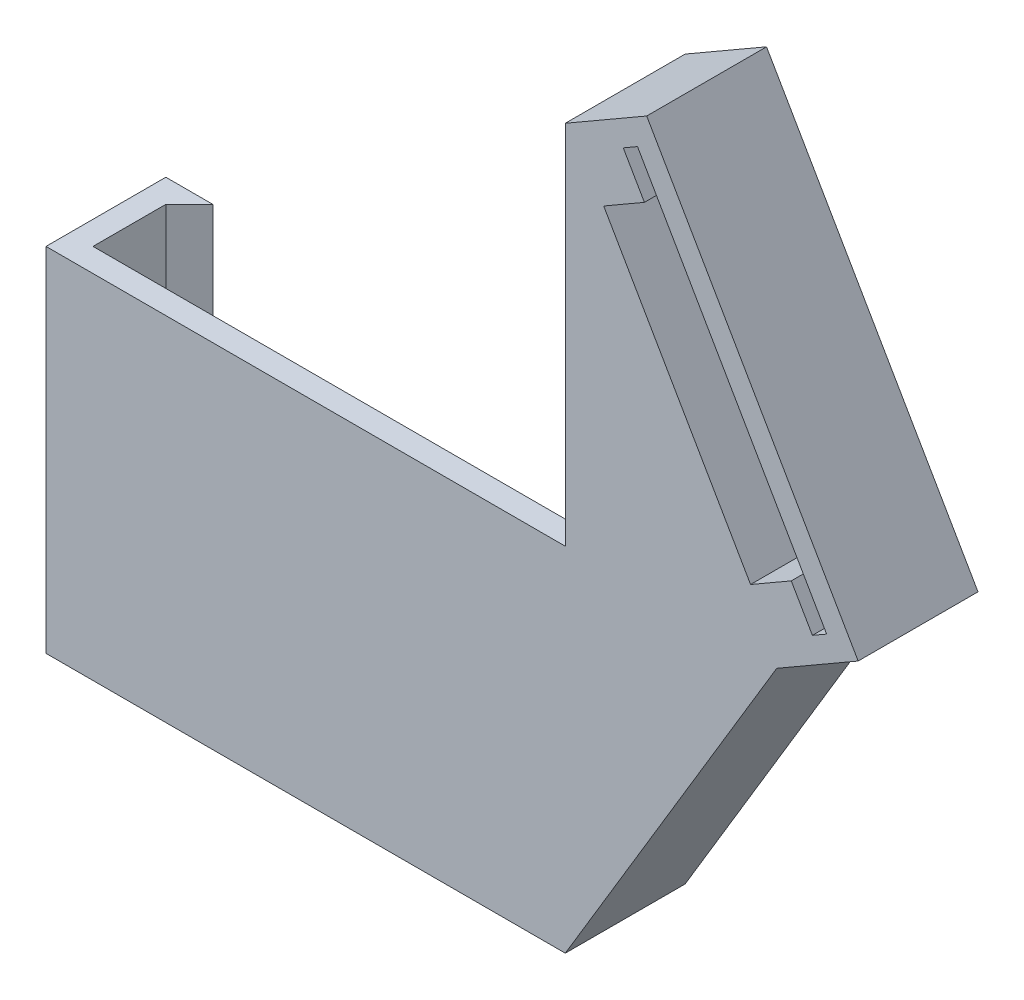
ISO-10303-21;
HEADER;
FILE_DESCRIPTION(('STEP AP214'),'2;1');
FILE_NAME('part.step','',(''),(''),'','','');
FILE_SCHEMA(('AUTOMOTIVE_DESIGN { 1 0 10303 214 1 1 1 1 }'));
ENDSEC;
DATA;
#1=APPLICATION_CONTEXT('core data for automotive mechanical design processes');
#2=APPLICATION_PROTOCOL_DEFINITION('international standard','automotive_design',2000,#1);
#3=PRODUCT_CONTEXT('',#1,'mechanical');
#4=PRODUCT('Part','Part','',(#3));
#5=PRODUCT_RELATED_PRODUCT_CATEGORY('part','',(#4));
#6=PRODUCT_DEFINITION_FORMATION('','',#4);
#7=PRODUCT_DEFINITION_CONTEXT('part definition',#1,'design');
#8=PRODUCT_DEFINITION('design','',#6,#7);
#9=PRODUCT_DEFINITION_SHAPE('','',#8);
#10=(LENGTH_UNIT() NAMED_UNIT(*) SI_UNIT(.MILLI.,.METRE.));
#11=(NAMED_UNIT(*) PLANE_ANGLE_UNIT() SI_UNIT($,.RADIAN.));
#12=(NAMED_UNIT(*) SI_UNIT($,.STERADIAN.) SOLID_ANGLE_UNIT());
#13=UNCERTAINTY_MEASURE_WITH_UNIT(LENGTH_MEASURE(1.E-05),#10,'distance_accuracy_value','');
#14=(GEOMETRIC_REPRESENTATION_CONTEXT(3) GLOBAL_UNCERTAINTY_ASSIGNED_CONTEXT((#13)) GLOBAL_UNIT_ASSIGNED_CONTEXT((#10,
#11,#12)) REPRESENTATION_CONTEXT('',''));
#15=CARTESIAN_POINT('',(0.,0.,0.));
#16=DIRECTION('',(0.,0.,1.));
#17=DIRECTION('',(1.,0.,0.));
#18=AXIS2_PLACEMENT_3D('',#15,#16,#17);
#19=CARTESIAN_POINT('',(-18.1,30.,-5.09999999999998));
#20=DIRECTION('',(-0.707106781186544,0.,-0.707106781186552));
#21=DIRECTION('',(-0.707106781186552,0.,0.707106781186544));
#22=AXIS2_PLACEMENT_3D('',#19,#20,#21);
#23=PLANE('',#22);
#24=DIRECTION('',(0.707106781186552,0.,-0.707106781186544));
#25=VECTOR('',#24,1.);
#26=CARTESIAN_POINT('',(-18.1,0.,-5.09999999999998));
#27=LINE('',#26,#25);
#28=CARTESIAN_POINT('',(-20.1,0.,-3.1));
#29=VERTEX_POINT('',#28);
#30=CARTESIAN_POINT('',(-18.1,0.,-5.09999999999998));
#31=VERTEX_POINT('',#30);
#32=EDGE_CURVE('E272',#29,#31,#27,.T.);
#33=ORIENTED_EDGE('',*,*,#32,.T.);
#34=DIRECTION('',(0.,-1.,0.));
#35=VECTOR('',#34,1.);
#36=CARTESIAN_POINT('',(-18.1,30.,-5.09999999999998));
#37=LINE('',#36,#35);
#38=CARTESIAN_POINT('',(-18.1,30.,-5.09999999999998));
#39=VERTEX_POINT('',#38);
#40=EDGE_CURVE('E11',#39,#31,#37,.T.);
#41=ORIENTED_EDGE('',*,*,#40,.F.);
#42=DIRECTION('',(0.707106781186552,0.,-0.707106781186544));
#43=VECTOR('',#42,1.);
#44=CARTESIAN_POINT('',(-18.1,30.,-5.09999999999998));
#45=LINE('',#44,#43);
#46=CARTESIAN_POINT('',(-20.1,30.,-3.1));
#47=VERTEX_POINT('',#46);
#48=EDGE_CURVE('E273',#47,#39,#45,.T.);
#49=ORIENTED_EDGE('',*,*,#48,.F.);
#50=DIRECTION('',(0.,-1.,0.));
#51=VECTOR('',#50,1.);
#52=CARTESIAN_POINT('',(-20.1,30.,-3.1));
#53=LINE('',#52,#51);
#54=EDGE_CURVE('E299',#47,#29,#53,.T.);
#55=ORIENTED_EDGE('',*,*,#54,.T.);
#56=EDGE_LOOP('',(#33,#41,#49,#55));
#57=FACE_BOUND('',#56,.T.);
#58=ADVANCED_FACE('F33',(#57),#23,.F.);
#59=CARTESIAN_POINT('',(-22.1,30.,-5.09999999999998));
#60=DIRECTION('',(0.,0.,1.));
#61=DIRECTION('',(1.,0.,0.));
#62=AXIS2_PLACEMENT_3D('',#59,#60,#61);
#63=PLANE('',#62);
#64=DIRECTION('',(-1.,0.,0.));
#65=VECTOR('',#64,1.);
#66=CARTESIAN_POINT('',(-22.1,0.,-5.09999999999998));
#67=LINE('',#66,#65);
#68=CARTESIAN_POINT('',(-22.1,0.,-5.09999999999998));
#69=VERTEX_POINT('',#68);
#70=EDGE_CURVE('E302',#31,#69,#67,.T.);
#71=ORIENTED_EDGE('',*,*,#70,.T.);
#72=DIRECTION('',(0.,-1.,0.));
#73=VECTOR('',#72,1.);
#74=CARTESIAN_POINT('',(-22.1,30.,-5.09999999999998));
#75=LINE('',#74,#73);
#76=CARTESIAN_POINT('',(-22.1,30.,-5.09999999999998));
#77=VERTEX_POINT('',#76);
#78=EDGE_CURVE('E40',#77,#69,#75,.T.);
#79=ORIENTED_EDGE('',*,*,#78,.F.);
#80=DIRECTION('',(-1.,0.,0.));
#81=VECTOR('',#80,1.);
#82=CARTESIAN_POINT('',(-22.1,30.,-5.09999999999998));
#83=LINE('',#82,#81);
#84=EDGE_CURVE('E276',#39,#77,#83,.T.);
#85=ORIENTED_EDGE('',*,*,#84,.F.);
#86=ORIENTED_EDGE('',*,*,#40,.T.);
#87=EDGE_LOOP('',(#71,#79,#85,#86));
#88=FACE_BOUND('',#87,.T.);
#89=ADVANCED_FACE('F363',(#88),#63,.F.);
#90=CARTESIAN_POINT('',(-22.1,30.,5.1));
#91=DIRECTION('',(1.,0.,0.));
#92=DIRECTION('',(0.,0.,-1.));
#93=AXIS2_PLACEMENT_3D('',#90,#91,#92);
#94=PLANE('',#93);
#95=DIRECTION('',(0.,0.,1.));
#96=VECTOR('',#95,1.);
#97=CARTESIAN_POINT('',(-22.1,0.,5.1));
#98=LINE('',#97,#96);
#99=CARTESIAN_POINT('',(-22.1,0.,5.1));
#100=VERTEX_POINT('',#99);
#101=EDGE_CURVE('E304',#69,#100,#98,.T.);
#102=ORIENTED_EDGE('',*,*,#101,.T.);
#103=DIRECTION('',(0.,-1.,0.));
#104=VECTOR('',#103,1.);
#105=CARTESIAN_POINT('',(-22.1,30.,5.1));
#106=LINE('',#105,#104);
#107=CARTESIAN_POINT('',(-22.1,30.,5.1));
#108=VERTEX_POINT('',#107);
#109=EDGE_CURVE('E340',#108,#100,#106,.T.);
#110=ORIENTED_EDGE('',*,*,#109,.F.);
#111=DIRECTION('',(0.,0.,1.));
#112=VECTOR('',#111,1.);
#113=CARTESIAN_POINT('',(-22.1,30.,5.1));
#114=LINE('',#113,#112);
#115=EDGE_CURVE('E279',#77,#108,#114,.T.);
#116=ORIENTED_EDGE('',*,*,#115,.F.);
#117=ORIENTED_EDGE('',*,*,#78,.T.);
#118=EDGE_LOOP('',(#102,#110,#116,#117));
#119=FACE_BOUND('',#118,.T.);
#120=ADVANCED_FACE('F347',(#119),#94,.F.);
#121=CARTESIAN_POINT('',(22.1,30.,5.1));
#122=DIRECTION('',(0.,0.,-1.));
#123=DIRECTION('',(-1.,0.,0.));
#124=AXIS2_PLACEMENT_3D('',#121,#122,#123);
#125=PLANE('',#124);
#126=DIRECTION('',(-0.499999999999995,0.866025403784442,0.));
#127=VECTOR('',#126,1.);
#128=CARTESIAN_POINT('',(44.3461524227063,34.6454482671903,5.1));
#129=LINE('',#128,#127);
#130=CARTESIAN_POINT('',(44.3461524227063,34.6454482671903,5.1));
#131=VERTEX_POINT('',#130);
#132=CARTESIAN_POINT('',(28.2461524227064,62.5314662690493,5.1));
#133=VERTEX_POINT('',#132);
#134=EDGE_CURVE('E199',#131,#133,#129,.T.);
#135=ORIENTED_EDGE('',*,*,#134,.F.);
#136=DIRECTION('',(0.866025403784442,0.499999999999994,0.));
#137=VECTOR('',#136,1.);
#138=CARTESIAN_POINT('',(44.3461524227063,34.6454482671903,5.1));
#139=LINE('',#138,#137);
#140=CARTESIAN_POINT('',(43.1337168574079,33.9454482671902,5.1));
#141=VERTEX_POINT('',#140);
#142=EDGE_CURVE('E47',#141,#131,#139,.T.);
#143=ORIENTED_EDGE('',*,*,#142,.F.);
#144=DIRECTION('',(0.499999999999966,-0.866025403784458,0.));
#145=VECTOR('',#144,1.);
#146=CARTESIAN_POINT('',(43.1337168574079,33.9454482671902,5.1));
#147=LINE('',#146,#145);
#148=CARTESIAN_POINT('',(41.333716857408,37.0631397208143,5.1));
#149=VERTEX_POINT('',#148);
#150=EDGE_CURVE('E221',#149,#141,#147,.T.);
#151=ORIENTED_EDGE('',*,*,#150,.F.);
#152=DIRECTION('',(0.866025403784443,0.499999999999992,0.));
#153=VECTOR('',#152,1.);
#154=CARTESIAN_POINT('',(41.333716857408,37.0631397208143,5.1));
#155=LINE('',#154,#153);
#156=CARTESIAN_POINT('',(37.8696152422702,35.0631397208143,5.1));
#157=VERTEX_POINT('',#156);
#158=EDGE_CURVE('E218',#157,#149,#155,.T.);
#159=ORIENTED_EDGE('',*,*,#158,.F.);
#160=DIRECTION('',(0.499999999999994,-0.866025403784442,0.));
#161=VECTOR('',#160,1.);
#162=CARTESIAN_POINT('',(25.3696152422703,56.7137748154253,5.1));
#163=LINE('',#162,#161);
#164=CARTESIAN_POINT('',(25.3696152422703,56.7137748154253,5.1));
#165=VERTEX_POINT('',#164);
#166=EDGE_CURVE('E215',#165,#157,#163,.T.);
#167=ORIENTED_EDGE('',*,*,#166,.F.);
#168=DIRECTION('',(-0.86602540378444,-0.499999999999997,0.));
#169=VECTOR('',#168,1.);
#170=CARTESIAN_POINT('',(28.8337168574081,58.7137748154253,5.1));
#171=LINE('',#170,#169);
#172=CARTESIAN_POINT('',(28.8337168574081,58.7137748154253,5.1));
#173=VERTEX_POINT('',#172);
#174=EDGE_CURVE('E209',#173,#165,#171,.T.);
#175=ORIENTED_EDGE('',*,*,#174,.F.);
#176=DIRECTION('',(0.499999999999962,-0.86602540378446,0.));
#177=VECTOR('',#176,1.);
#178=CARTESIAN_POINT('',(28.8337168574081,58.7137748154253,5.1));
#179=LINE('',#178,#177);
#180=CARTESIAN_POINT('',(27.0337168574082,61.8314662690493,5.1));
#181=VERTEX_POINT('',#180);
#182=EDGE_CURVE('E207',#181,#173,#179,.T.);
#183=ORIENTED_EDGE('',*,*,#182,.F.);
#184=DIRECTION('',(-0.866025403784446,-0.499999999999988,0.));
#185=VECTOR('',#184,1.);
#186=CARTESIAN_POINT('',(28.2461524227064,62.5314662690493,5.1));
#187=LINE('',#186,#185);
#188=EDGE_CURVE('E190',#133,#181,#187,.T.);
#189=ORIENTED_EDGE('',*,*,#188,.F.);
#190=EDGE_LOOP('',(#135,#143,#151,#159,#167,#175,#183,#189));
#191=FACE_BOUND('',#190,.T.);
#192=DIRECTION('',(1.,0.,0.));
#193=VECTOR('',#192,1.);
#194=CARTESIAN_POINT('',(22.1,0.,5.1));
#195=LINE('',#194,#193);
#196=CARTESIAN_POINT('',(22.1,0.,5.1));
#197=VERTEX_POINT('',#196);
#198=EDGE_CURVE('E306',#100,#197,#195,.T.);
#199=ORIENTED_EDGE('',*,*,#198,.T.);
#200=DIRECTION('',(0.514495755427523,0.857492925712547,0.));
#201=VECTOR('',#200,1.);
#202=CARTESIAN_POINT('',(40.0999999999998,30.,5.1));
#203=LINE('',#202,#201);
#204=CARTESIAN_POINT('',(40.0999999999998,30.,5.1));
#205=VERTEX_POINT('',#204);
#206=EDGE_CURVE('E261',#197,#205,#203,.T.);
#207=ORIENTED_EDGE('',*,*,#206,.T.);
#208=DIRECTION('',(0.866025403784442,0.499999999999994,0.));
#209=VECTOR('',#208,1.);
#210=CARTESIAN_POINT('',(47.0282032302753,34.,5.1));
#211=LINE('',#210,#209);
#212=CARTESIAN_POINT('',(47.0282032302753,34.,5.1));
#213=VERTEX_POINT('',#212);
#214=EDGE_CURVE('E238',#205,#213,#211,.T.);
#215=ORIENTED_EDGE('',*,*,#214,.T.);
#216=DIRECTION('',(-0.499999999999994,0.866025403784442,0.));
#217=VECTOR('',#216,1.);
#218=CARTESIAN_POINT('',(47.0282032302753,34.,5.1));
#219=LINE('',#218,#217);
#220=CARTESIAN_POINT('',(29.0282032302756,65.1769145362399,5.1));
#221=VERTEX_POINT('',#220);
#222=EDGE_CURVE('E252',#213,#221,#219,.T.);
#223=ORIENTED_EDGE('',*,*,#222,.T.);
#224=DIRECTION('',(-0.866025403784441,-0.499999999999996,0.));
#225=VECTOR('',#224,1.);
#226=CARTESIAN_POINT('',(29.0282032302756,65.1769145362399,5.1));
#227=LINE('',#226,#225);
#228=CARTESIAN_POINT('',(22.1,61.1769145362399,5.1));
#229=VERTEX_POINT('',#228);
#230=EDGE_CURVE('E255',#221,#229,#227,.T.);
#231=ORIENTED_EDGE('',*,*,#230,.T.);
#232=DIRECTION('',(0.,-1.,0.));
#233=VECTOR('',#232,1.);
#234=CARTESIAN_POINT('',(22.1,0.,5.1));
#235=LINE('',#234,#233);
#236=CARTESIAN_POINT('',(22.1,30.,5.1));
#237=VERTEX_POINT('',#236);
#238=EDGE_CURVE('E258',#229,#237,#235,.T.);
#239=ORIENTED_EDGE('',*,*,#238,.T.);
#240=DIRECTION('',(1.,0.,0.));
#241=VECTOR('',#240,1.);
#242=CARTESIAN_POINT('',(22.1,30.,5.1));
#243=LINE('',#242,#241);
#244=EDGE_CURVE('E281',#108,#237,#243,.T.);
#245=ORIENTED_EDGE('',*,*,#244,.F.);
#246=ORIENTED_EDGE('',*,*,#109,.T.);
#247=EDGE_LOOP('',(#199,#207,#215,#223,#231,#239,#245,#246));
#248=FACE_BOUND('',#247,.T.);
#249=ADVANCED_FACE('F203',(#191,#248),#125,.F.);
#250=CARTESIAN_POINT('',(18.1,30.,-5.09999999999998));
#251=DIRECTION('',(0.,0.,1.));
#252=DIRECTION('',(1.,0.,0.));
#253=AXIS2_PLACEMENT_3D('',#250,#251,#252);
#254=PLANE('',#253);
#255=DIRECTION('',(-0.499999999999966,0.866025403784458,0.));
#256=VECTOR('',#255,1.);
#257=CARTESIAN_POINT('',(43.1337168574079,33.9454482671902,-5.09999999999999));
#258=LINE('',#257,#256);
#259=CARTESIAN_POINT('',(43.1337168574079,33.9454482671902,-5.09999999999999));
#260=VERTEX_POINT('',#259);
#261=CARTESIAN_POINT('',(41.333716857408,37.0631397208143,-5.09999999999999));
#262=VERTEX_POINT('',#261);
#263=EDGE_CURVE('E488',#260,#262,#258,.T.);
#264=ORIENTED_EDGE('',*,*,#263,.F.);
#265=DIRECTION('',(-0.866025403784442,-0.499999999999994,0.));
#266=VECTOR('',#265,1.);
#267=CARTESIAN_POINT('',(44.3461524227063,34.6454482671903,-5.09999999999999));
#268=LINE('',#267,#266);
#269=CARTESIAN_POINT('',(44.3461524227063,34.6454482671903,-5.09999999999999));
#270=VERTEX_POINT('',#269);
#271=EDGE_CURVE('E239',#270,#260,#268,.T.);
#272=ORIENTED_EDGE('',*,*,#271,.F.);
#273=DIRECTION('',(0.499999999999995,-0.866025403784442,0.));
#274=VECTOR('',#273,1.);
#275=CARTESIAN_POINT('',(44.3461524227063,34.6454482671903,-5.09999999999999));
#276=LINE('',#275,#274);
#277=CARTESIAN_POINT('',(28.2461524227065,62.5314662690493,-5.09999999999998));
#278=VERTEX_POINT('',#277);
#279=EDGE_CURVE('E236',#278,#270,#276,.T.);
#280=ORIENTED_EDGE('',*,*,#279,.F.);
#281=DIRECTION('',(0.866025403784446,0.499999999999988,0.));
#282=VECTOR('',#281,1.);
#283=CARTESIAN_POINT('',(28.2461524227065,62.5314662690493,-5.09999999999998));
#284=LINE('',#283,#282);
#285=CARTESIAN_POINT('',(27.0337168574082,61.8314662690493,-5.09999999999998));
#286=VERTEX_POINT('',#285);
#287=EDGE_CURVE('E193',#286,#278,#284,.T.);
#288=ORIENTED_EDGE('',*,*,#287,.F.);
#289=DIRECTION('',(-0.499999999999962,0.86602540378446,0.));
#290=VECTOR('',#289,1.);
#291=CARTESIAN_POINT('',(28.8337168574081,58.7137748154253,-5.09999999999998));
#292=LINE('',#291,#290);
#293=CARTESIAN_POINT('',(28.8337168574081,58.7137748154253,-5.09999999999998));
#294=VERTEX_POINT('',#293);
#295=EDGE_CURVE('E506',#294,#286,#292,.T.);
#296=ORIENTED_EDGE('',*,*,#295,.F.);
#297=DIRECTION('',(0.86602540378444,0.499999999999997,0.));
#298=VECTOR('',#297,1.);
#299=CARTESIAN_POINT('',(28.8337168574081,58.7137748154253,-5.09999999999998));
#300=LINE('',#299,#298);
#301=CARTESIAN_POINT('',(25.3696152422703,56.7137748154253,-5.09999999999998));
#302=VERTEX_POINT('',#301);
#303=EDGE_CURVE('E501',#302,#294,#300,.T.);
#304=ORIENTED_EDGE('',*,*,#303,.F.);
#305=DIRECTION('',(-0.499999999999994,0.866025403784442,0.));
#306=VECTOR('',#305,1.);
#307=CARTESIAN_POINT('',(25.3696152422703,56.7137748154253,-5.09999999999998));
#308=LINE('',#307,#306);
#309=CARTESIAN_POINT('',(37.8696152422702,35.0631397208143,-5.09999999999998));
#310=VERTEX_POINT('',#309);
#311=EDGE_CURVE('E499',#310,#302,#308,.T.);
#312=ORIENTED_EDGE('',*,*,#311,.F.);
#313=DIRECTION('',(-0.866025403784443,-0.499999999999992,0.));
#314=VECTOR('',#313,1.);
#315=CARTESIAN_POINT('',(41.333716857408,37.0631397208143,-5.09999999999999));
#316=LINE('',#315,#314);
#317=EDGE_CURVE('E492',#262,#310,#316,.T.);
#318=ORIENTED_EDGE('',*,*,#317,.F.);
#319=EDGE_LOOP('',(#264,#272,#280,#288,#296,#304,#312,#318));
#320=FACE_BOUND('',#319,.T.);
#321=DIRECTION('',(-1.,0.,0.));
#322=VECTOR('',#321,1.);
#323=CARTESIAN_POINT('',(18.1,0.,-5.09999999999998));
#324=LINE('',#323,#322);
#325=CARTESIAN_POINT('',(22.1,0.,-5.09999999999998));
#326=VERTEX_POINT('',#325);
#327=CARTESIAN_POINT('',(18.1,0.,-5.09999999999998));
#328=VERTEX_POINT('',#327);
#329=EDGE_CURVE('E312',#326,#328,#324,.T.);
#330=ORIENTED_EDGE('',*,*,#329,.T.);
#331=DIRECTION('',(0.,-1.,0.));
#332=VECTOR('',#331,1.);
#333=CARTESIAN_POINT('',(18.1,30.,-5.09999999999998));
#334=LINE('',#333,#332);
#335=CARTESIAN_POINT('',(18.1,30.,-5.09999999999998));
#336=VERTEX_POINT('',#335);
#337=EDGE_CURVE('E337',#336,#328,#334,.T.);
#338=ORIENTED_EDGE('',*,*,#337,.F.);
#339=DIRECTION('',(-1.,0.,0.));
#340=VECTOR('',#339,1.);
#341=CARTESIAN_POINT('',(18.1,30.,-5.09999999999998));
#342=LINE('',#341,#340);
#343=CARTESIAN_POINT('',(22.1,30.,-5.09999999999998));
#344=VERTEX_POINT('',#343);
#345=EDGE_CURVE('E287',#344,#336,#342,.T.);
#346=ORIENTED_EDGE('',*,*,#345,.F.);
#347=DIRECTION('',(0.,1.,0.));
#348=VECTOR('',#347,1.);
#349=CARTESIAN_POINT('',(22.1,0.,-5.09999999999998));
#350=LINE('',#349,#348);
#351=CARTESIAN_POINT('',(22.1,61.1769145362399,-5.09999999999998));
#352=VERTEX_POINT('',#351);
#353=EDGE_CURVE('E242',#344,#352,#350,.T.);
#354=ORIENTED_EDGE('',*,*,#353,.T.);
#355=DIRECTION('',(0.866025403784441,0.499999999999996,0.));
#356=VECTOR('',#355,1.);
#357=CARTESIAN_POINT('',(29.0282032302756,65.1769145362399,-5.09999999999998));
#358=LINE('',#357,#356);
#359=CARTESIAN_POINT('',(29.0282032302756,65.1769145362399,-5.09999999999998));
#360=VERTEX_POINT('',#359);
#361=EDGE_CURVE('E240',#352,#360,#358,.T.);
#362=ORIENTED_EDGE('',*,*,#361,.T.);
#363=DIRECTION('',(0.499999999999994,-0.866025403784442,0.));
#364=VECTOR('',#363,1.);
#365=CARTESIAN_POINT('',(47.0282032302753,34.,-5.09999999999998));
#366=LINE('',#365,#364);
#367=CARTESIAN_POINT('',(47.0282032302753,34.,-5.09999999999998));
#368=VERTEX_POINT('',#367);
#369=EDGE_CURVE('E249',#360,#368,#366,.T.);
#370=ORIENTED_EDGE('',*,*,#369,.T.);
#371=DIRECTION('',(-0.866025403784442,-0.499999999999994,0.));
#372=VECTOR('',#371,1.);
#373=CARTESIAN_POINT('',(47.0282032302754,34.,-5.09999999999998));
#374=LINE('',#373,#372);
#375=CARTESIAN_POINT('',(40.0999999999998,30.,-5.09999999999998));
#376=VERTEX_POINT('',#375);
#377=EDGE_CURVE('E247',#368,#376,#374,.T.);
#378=ORIENTED_EDGE('',*,*,#377,.T.);
#379=DIRECTION('',(-0.514495755427523,-0.857492925712547,0.));
#380=VECTOR('',#379,1.);
#381=CARTESIAN_POINT('',(40.0999999999998,30.,-5.09999999999998));
#382=LINE('',#381,#380);
#383=EDGE_CURVE('E245',#376,#326,#382,.T.);
#384=ORIENTED_EDGE('',*,*,#383,.T.);
#385=EDGE_LOOP('',(#330,#338,#346,#354,#362,#370,#378,#384));
#386=FACE_BOUND('',#385,.T.);
#387=ADVANCED_FACE('F392',(#320,#386),#254,.F.);
#388=CARTESIAN_POINT('',(18.1,30.,-3.09999999999998));
#389=DIRECTION('',(1.,0.,0.));
#390=DIRECTION('',(0.,0.,-1.));
#391=AXIS2_PLACEMENT_3D('',#388,#389,#390);
#392=PLANE('',#391);
#393=DIRECTION('',(0.,0.,1.));
#394=VECTOR('',#393,1.);
#395=CARTESIAN_POINT('',(18.1,0.,-3.09999999999998));
#396=LINE('',#395,#394);
#397=CARTESIAN_POINT('',(18.1,0.,-3.09999999999998));
#398=VERTEX_POINT('',#397);
#399=EDGE_CURVE('E314',#328,#398,#396,.T.);
#400=ORIENTED_EDGE('',*,*,#399,.T.);
#401=DIRECTION('',(0.,-1.,0.));
#402=VECTOR('',#401,1.);
#403=CARTESIAN_POINT('',(18.1,30.,-3.09999999999998));
#404=LINE('',#403,#402);
#405=CARTESIAN_POINT('',(18.1,30.,-3.09999999999998));
#406=VERTEX_POINT('',#405);
#407=EDGE_CURVE('E334',#406,#398,#404,.T.);
#408=ORIENTED_EDGE('',*,*,#407,.F.);
#409=DIRECTION('',(0.,0.,1.));
#410=VECTOR('',#409,1.);
#411=CARTESIAN_POINT('',(18.1,30.,-3.09999999999998));
#412=LINE('',#411,#410);
#413=EDGE_CURVE('E289',#336,#406,#412,.T.);
#414=ORIENTED_EDGE('',*,*,#413,.F.);
#415=ORIENTED_EDGE('',*,*,#337,.T.);
#416=EDGE_LOOP('',(#400,#408,#414,#415));
#417=FACE_BOUND('',#416,.T.);
#418=ADVANCED_FACE('F389',(#417),#392,.F.);
#419=CARTESIAN_POINT('',(20.1,30.,-3.1));
#420=DIRECTION('',(0.,0.,-1.));
#421=DIRECTION('',(-1.,0.,0.));
#422=AXIS2_PLACEMENT_3D('',#419,#420,#421);
#423=PLANE('',#422);
#424=DIRECTION('',(1.,0.,0.));
#425=VECTOR('',#424,1.);
#426=CARTESIAN_POINT('',(20.1,0.,-3.1));
#427=LINE('',#426,#425);
#428=CARTESIAN_POINT('',(20.1,0.,-3.1));
#429=VERTEX_POINT('',#428);
#430=EDGE_CURVE('E316',#398,#429,#427,.T.);
#431=ORIENTED_EDGE('',*,*,#430,.T.);
#432=DIRECTION('',(0.,-1.,0.));
#433=VECTOR('',#432,1.);
#434=CARTESIAN_POINT('',(20.1,30.,-3.1));
#435=LINE('',#434,#433);
#436=CARTESIAN_POINT('',(20.1,30.,-3.1));
#437=VERTEX_POINT('',#436);
#438=EDGE_CURVE('E331',#437,#429,#435,.T.);
#439=ORIENTED_EDGE('',*,*,#438,.F.);
#440=DIRECTION('',(1.,0.,0.));
#441=VECTOR('',#440,1.);
#442=CARTESIAN_POINT('',(20.1,30.,-3.1));
#443=LINE('',#442,#441);
#444=EDGE_CURVE('E291',#406,#437,#443,.T.);
#445=ORIENTED_EDGE('',*,*,#444,.F.);
#446=ORIENTED_EDGE('',*,*,#407,.T.);
#447=EDGE_LOOP('',(#431,#439,#445,#446));
#448=FACE_BOUND('',#447,.T.);
#449=ADVANCED_FACE('F384',(#448),#423,.F.);
#450=CARTESIAN_POINT('',(20.1,30.,3.1));
#451=DIRECTION('',(1.,0.,0.));
#452=DIRECTION('',(0.,0.,-1.));
#453=AXIS2_PLACEMENT_3D('',#450,#451,#452);
#454=PLANE('',#453);
#455=DIRECTION('',(0.,0.,1.));
#456=VECTOR('',#455,1.);
#457=CARTESIAN_POINT('',(20.1,0.,3.1));
#458=LINE('',#457,#456);
#459=CARTESIAN_POINT('',(20.1,0.,3.1));
#460=VERTEX_POINT('',#459);
#461=EDGE_CURVE('E318',#429,#460,#458,.T.);
#462=ORIENTED_EDGE('',*,*,#461,.T.);
#463=DIRECTION('',(0.,-1.,0.));
#464=VECTOR('',#463,1.);
#465=CARTESIAN_POINT('',(20.1,30.,3.1));
#466=LINE('',#465,#464);
#467=CARTESIAN_POINT('',(20.1,30.,3.1));
#468=VERTEX_POINT('',#467);
#469=EDGE_CURVE('E328',#468,#460,#466,.T.);
#470=ORIENTED_EDGE('',*,*,#469,.F.);
#471=DIRECTION('',(0.,0.,1.));
#472=VECTOR('',#471,1.);
#473=CARTESIAN_POINT('',(20.1,30.,3.1));
#474=LINE('',#473,#472);
#475=EDGE_CURVE('E293',#437,#468,#474,.T.);
#476=ORIENTED_EDGE('',*,*,#475,.F.);
#477=ORIENTED_EDGE('',*,*,#438,.T.);
#478=EDGE_LOOP('',(#462,#470,#476,#477));
#479=FACE_BOUND('',#478,.T.);
#480=ADVANCED_FACE('F379',(#479),#454,.F.);
#481=CARTESIAN_POINT('',(20.1,30.,3.1));
#482=DIRECTION('',(0.,0.,1.));
#483=DIRECTION('',(1.,0.,0.));
#484=AXIS2_PLACEMENT_3D('',#481,#482,#483);
#485=PLANE('',#484);
#486=DIRECTION('',(-1.,0.,0.));
#487=VECTOR('',#486,1.);
#488=CARTESIAN_POINT('',(20.1,0.,3.1));
#489=LINE('',#488,#487);
#490=CARTESIAN_POINT('',(-20.1,0.,3.1));
#491=VERTEX_POINT('',#490);
#492=EDGE_CURVE('E320',#460,#491,#489,.T.);
#493=ORIENTED_EDGE('',*,*,#492,.T.);
#494=DIRECTION('',(0.,-1.,0.));
#495=VECTOR('',#494,1.);
#496=CARTESIAN_POINT('',(-20.1,30.,3.1));
#497=LINE('',#496,#495);
#498=CARTESIAN_POINT('',(-20.1,30.,3.1));
#499=VERTEX_POINT('',#498);
#500=EDGE_CURVE('E325',#499,#491,#497,.T.);
#501=ORIENTED_EDGE('',*,*,#500,.F.);
#502=DIRECTION('',(-1.,0.,0.));
#503=VECTOR('',#502,1.);
#504=CARTESIAN_POINT('',(20.1,30.,3.1));
#505=LINE('',#504,#503);
#506=EDGE_CURVE('E295',#468,#499,#505,.T.);
#507=ORIENTED_EDGE('',*,*,#506,.F.);
#508=ORIENTED_EDGE('',*,*,#469,.T.);
#509=EDGE_LOOP('',(#493,#501,#507,#508));
#510=FACE_BOUND('',#509,.T.);
#511=ADVANCED_FACE('F375',(#510),#485,.F.);
#512=CARTESIAN_POINT('',(-20.1,30.,3.1));
#513=DIRECTION('',(-1.,0.,0.));
#514=DIRECTION('',(0.,0.,1.));
#515=AXIS2_PLACEMENT_3D('',#512,#513,#514);
#516=PLANE('',#515);
#517=DIRECTION('',(0.,0.,-1.));
#518=VECTOR('',#517,1.);
#519=CARTESIAN_POINT('',(-20.1,0.,3.1));
#520=LINE('',#519,#518);
#521=EDGE_CURVE('E277',#491,#29,#520,.T.);
#522=ORIENTED_EDGE('',*,*,#521,.T.);
#523=ORIENTED_EDGE('',*,*,#54,.F.);
#524=DIRECTION('',(0.,0.,-1.));
#525=VECTOR('',#524,1.);
#526=CARTESIAN_POINT('',(-20.1,30.,3.1));
#527=LINE('',#526,#525);
#528=EDGE_CURVE('E297',#499,#47,#527,.T.);
#529=ORIENTED_EDGE('',*,*,#528,.F.);
#530=ORIENTED_EDGE('',*,*,#500,.T.);
#531=EDGE_LOOP('',(#522,#523,#529,#530));
#532=FACE_BOUND('',#531,.T.);
#533=ADVANCED_FACE('F370',(#532),#516,.F.);
#534=CARTESIAN_POINT('',(0.,30.,0.));
#535=DIRECTION('',(0.,-1.,0.));
#536=DIRECTION('',(0.,0.,-1.));
#537=AXIS2_PLACEMENT_3D('',#534,#535,#536);
#538=PLANE('',#537);
#539=ORIENTED_EDGE('',*,*,#48,.T.);
#540=ORIENTED_EDGE('',*,*,#84,.T.);
#541=ORIENTED_EDGE('',*,*,#115,.T.);
#542=ORIENTED_EDGE('',*,*,#244,.T.);
#543=DIRECTION('',(0.,0.,-1.));
#544=VECTOR('',#543,1.);
#545=CARTESIAN_POINT('',(22.1,30.,-5.09999999999998));
#546=LINE('',#545,#544);
#547=EDGE_CURVE('E284',#237,#344,#546,.T.);
#548=ORIENTED_EDGE('',*,*,#547,.T.);
#549=ORIENTED_EDGE('',*,*,#345,.T.);
#550=ORIENTED_EDGE('',*,*,#413,.T.);
#551=ORIENTED_EDGE('',*,*,#444,.T.);
#552=ORIENTED_EDGE('',*,*,#475,.T.);
#553=ORIENTED_EDGE('',*,*,#506,.T.);
#554=ORIENTED_EDGE('',*,*,#528,.T.);
#555=EDGE_LOOP('',(#539,#540,#541,#542,#548,#549,#550,#551,#552,#553,#554));
#556=FACE_BOUND('',#555,.T.);
#557=ADVANCED_FACE('F359',(#556),#538,.F.);
#558=CARTESIAN_POINT('',(0.,0.,0.));
#559=DIRECTION('',(0.,-1.,0.));
#560=DIRECTION('',(0.,0.,-1.));
#561=AXIS2_PLACEMENT_3D('',#558,#559,#560);
#562=PLANE('',#561);
#563=ORIENTED_EDGE('',*,*,#32,.F.);
#564=ORIENTED_EDGE('',*,*,#521,.F.);
#565=ORIENTED_EDGE('',*,*,#492,.F.);
#566=ORIENTED_EDGE('',*,*,#461,.F.);
#567=ORIENTED_EDGE('',*,*,#430,.F.);
#568=ORIENTED_EDGE('',*,*,#399,.F.);
#569=ORIENTED_EDGE('',*,*,#329,.F.);
#570=DIRECTION('',(0.,0.,-1.));
#571=VECTOR('',#570,1.);
#572=CARTESIAN_POINT('',(22.1,0.,-5.09999999999998));
#573=LINE('',#572,#571);
#574=EDGE_CURVE('E309',#197,#326,#573,.T.);
#575=ORIENTED_EDGE('',*,*,#574,.F.);
#576=ORIENTED_EDGE('',*,*,#198,.F.);
#577=ORIENTED_EDGE('',*,*,#101,.F.);
#578=ORIENTED_EDGE('',*,*,#70,.F.);
#579=EDGE_LOOP('',(#563,#564,#565,#566,#567,#568,#569,#575,#576,#577,#578));
#580=FACE_BOUND('',#579,.T.);
#581=ADVANCED_FACE('F353',(#580),#562,.T.);
#582=CARTESIAN_POINT('',(22.1,0.,-74.8814123155603));
#583=DIRECTION('',(-1.,0.,0.));
#584=DIRECTION('',(0.,0.,1.));
#585=AXIS2_PLACEMENT_3D('',#582,#583,#584);
#586=PLANE('',#585);
#587=ORIENTED_EDGE('',*,*,#547,.F.);
#588=ORIENTED_EDGE('',*,*,#238,.F.);
#589=DIRECTION('',(0.,0.,1.));
#590=VECTOR('',#589,1.);
#591=CARTESIAN_POINT('',(22.1,61.1769145362399,-74.8814123155603));
#592=LINE('',#591,#590);
#593=EDGE_CURVE('E266',#352,#229,#592,.T.);
#594=ORIENTED_EDGE('',*,*,#593,.F.);
#595=ORIENTED_EDGE('',*,*,#353,.F.);
#596=EDGE_LOOP('',(#587,#588,#594,#595));
#597=FACE_BOUND('',#596,.T.);
#598=ADVANCED_FACE('F413',(#597),#586,.T.);
#599=CARTESIAN_POINT('',(47.0282032302753,34.,-74.8814123155603));
#600=DIRECTION('',(0.499999999999994,-0.866025403784442,0.));
#601=DIRECTION('',(0.866025403784442,0.499999999999994,0.));
#602=AXIS2_PLACEMENT_3D('',#599,#600,#601);
#603=PLANE('',#602);
#604=ORIENTED_EDGE('',*,*,#377,.F.);
#605=DIRECTION('',(0.,0.,1.));
#606=VECTOR('',#605,1.);
#607=CARTESIAN_POINT('',(47.0282032302753,34.,-74.8814123155603));
#608=LINE('',#607,#606);
#609=EDGE_CURVE('E264',#368,#213,#608,.T.);
#610=ORIENTED_EDGE('',*,*,#609,.T.);
#611=ORIENTED_EDGE('',*,*,#214,.F.);
#612=DIRECTION('',(0.,0.,1.));
#613=VECTOR('',#612,1.);
#614=CARTESIAN_POINT('',(40.0999999999998,30.,-74.8814123155603));
#615=LINE('',#614,#613);
#616=EDGE_CURVE('E243',#376,#205,#615,.T.);
#617=ORIENTED_EDGE('',*,*,#616,.F.);
#618=EDGE_LOOP('',(#604,#610,#611,#617));
#619=FACE_BOUND('',#618,.T.);
#620=ADVANCED_FACE('F400',(#619),#603,.T.);
#621=CARTESIAN_POINT('',(40.0999999999998,30.,-74.8814123155603));
#622=DIRECTION('',(0.857492925712547,-0.514495755427523,0.));
#623=DIRECTION('',(0.514495755427523,0.857492925712547,0.));
#624=AXIS2_PLACEMENT_3D('',#621,#622,#623);
#625=PLANE('',#624);
#626=ORIENTED_EDGE('',*,*,#383,.F.);
#627=ORIENTED_EDGE('',*,*,#616,.T.);
#628=ORIENTED_EDGE('',*,*,#206,.F.);
#629=ORIENTED_EDGE('',*,*,#574,.T.);
#630=EDGE_LOOP('',(#626,#627,#628,#629));
#631=FACE_BOUND('',#630,.T.);
#632=ADVANCED_FACE('F397',(#631),#625,.T.);
#633=CARTESIAN_POINT('',(29.0282032302756,65.1769145362399,-74.8814123155603));
#634=DIRECTION('',(-0.499999999999996,0.866025403784441,0.));
#635=DIRECTION('',(-0.866025403784441,-0.499999999999996,0.));
#636=AXIS2_PLACEMENT_3D('',#633,#634,#635);
#637=PLANE('',#636);
#638=ORIENTED_EDGE('',*,*,#361,.F.);
#639=ORIENTED_EDGE('',*,*,#593,.T.);
#640=ORIENTED_EDGE('',*,*,#230,.F.);
#641=DIRECTION('',(0.,0.,1.));
#642=VECTOR('',#641,1.);
#643=CARTESIAN_POINT('',(29.0282032302756,65.1769145362399,-74.8814123155603));
#644=LINE('',#643,#642);
#645=EDGE_CURVE('E268',#360,#221,#644,.T.);
#646=ORIENTED_EDGE('',*,*,#645,.F.);
#647=EDGE_LOOP('',(#638,#639,#640,#646));
#648=FACE_BOUND('',#647,.T.);
#649=ADVANCED_FACE('F410',(#648),#637,.T.);
#650=CARTESIAN_POINT('',(47.0282032302753,34.,-74.8814123155603));
#651=DIRECTION('',(0.866025403784442,0.499999999999994,0.));
#652=DIRECTION('',(-0.499999999999994,0.866025403784442,0.));
#653=AXIS2_PLACEMENT_3D('',#650,#651,#652);
#654=PLANE('',#653);
#655=ORIENTED_EDGE('',*,*,#369,.F.);
#656=ORIENTED_EDGE('',*,*,#645,.T.);
#657=ORIENTED_EDGE('',*,*,#222,.F.);
#658=ORIENTED_EDGE('',*,*,#609,.F.);
#659=EDGE_LOOP('',(#655,#656,#657,#658));
#660=FACE_BOUND('',#659,.T.);
#661=ADVANCED_FACE('F406',(#660),#654,.T.);
#662=CARTESIAN_POINT('',(44.3461524227063,34.6454482671903,-39.4113594683026));
#663=DIRECTION('',(0.499999999999994,-0.866025403784442,0.));
#664=DIRECTION('',(0.866025403784442,0.499999999999994,0.));
#665=AXIS2_PLACEMENT_3D('',#662,#663,#664);
#666=PLANE('',#665);
#667=ORIENTED_EDGE('',*,*,#271,.T.);
#668=DIRECTION('',(0.,0.,1.));
#669=VECTOR('',#668,1.);
#670=CARTESIAN_POINT('',(43.1337168574079,33.9454482671902,-39.4113594683026));
#671=LINE('',#670,#669);
#672=EDGE_CURVE('E224',#260,#141,#671,.T.);
#673=ORIENTED_EDGE('',*,*,#672,.T.);
#674=ORIENTED_EDGE('',*,*,#142,.T.);
#675=DIRECTION('',(0.,0.,1.));
#676=VECTOR('',#675,1.);
#677=CARTESIAN_POINT('',(44.3461524227063,34.6454482671903,-39.4113594683026));
#678=LINE('',#677,#676);
#679=EDGE_CURVE('E196',#270,#131,#678,.T.);
#680=ORIENTED_EDGE('',*,*,#679,.F.);
#681=EDGE_LOOP('',(#667,#673,#674,#680));
#682=FACE_BOUND('',#681,.T.);
#683=ADVANCED_FACE('F451',(#682),#666,.F.);
#684=CARTESIAN_POINT('',(43.1337168574079,33.9454482671902,-39.4113594683026));
#685=DIRECTION('',(-0.866025403784458,-0.499999999999966,0.));
#686=DIRECTION('',(0.499999999999966,-0.866025403784458,0.));
#687=AXIS2_PLACEMENT_3D('',#684,#685,#686);
#688=PLANE('',#687);
#689=ORIENTED_EDGE('',*,*,#263,.T.);
#690=DIRECTION('',(0.,0.,1.));
#691=VECTOR('',#690,1.);
#692=CARTESIAN_POINT('',(41.333716857408,37.0631397208143,-39.4113594683026));
#693=LINE('',#692,#691);
#694=EDGE_CURVE('E226',#262,#149,#693,.T.);
#695=ORIENTED_EDGE('',*,*,#694,.T.);
#696=ORIENTED_EDGE('',*,*,#150,.T.);
#697=ORIENTED_EDGE('',*,*,#672,.F.);
#698=EDGE_LOOP('',(#689,#695,#696,#697));
#699=FACE_BOUND('',#698,.T.);
#700=ADVANCED_FACE('F461',(#699),#688,.F.);
#701=CARTESIAN_POINT('',(41.333716857408,37.0631397208143,-39.4113594683026));
#702=DIRECTION('',(0.499999999999992,-0.866025403784443,0.));
#703=DIRECTION('',(0.866025403784443,0.499999999999992,0.));
#704=AXIS2_PLACEMENT_3D('',#701,#702,#703);
#705=PLANE('',#704);
#706=ORIENTED_EDGE('',*,*,#317,.T.);
#707=DIRECTION('',(0.,0.,1.));
#708=VECTOR('',#707,1.);
#709=CARTESIAN_POINT('',(37.8696152422702,35.0631397208143,-39.4113594683026));
#710=LINE('',#709,#708);
#711=EDGE_CURVE('E228',#310,#157,#710,.T.);
#712=ORIENTED_EDGE('',*,*,#711,.T.);
#713=ORIENTED_EDGE('',*,*,#158,.T.);
#714=ORIENTED_EDGE('',*,*,#694,.F.);
#715=EDGE_LOOP('',(#706,#712,#713,#714));
#716=FACE_BOUND('',#715,.T.);
#717=ADVANCED_FACE('F477',(#716),#705,.F.);
#718=CARTESIAN_POINT('',(25.3696152422703,56.7137748154253,-39.4113594683026));
#719=DIRECTION('',(-0.866025403784442,-0.499999999999994,0.));
#720=DIRECTION('',(0.499999999999994,-0.866025403784442,0.));
#721=AXIS2_PLACEMENT_3D('',#718,#719,#720);
#722=PLANE('',#721);
#723=ORIENTED_EDGE('',*,*,#311,.T.);
#724=DIRECTION('',(0.,0.,1.));
#725=VECTOR('',#724,1.);
#726=CARTESIAN_POINT('',(25.3696152422703,56.7137748154253,-39.4113594683026));
#727=LINE('',#726,#725);
#728=EDGE_CURVE('E230',#302,#165,#727,.T.);
#729=ORIENTED_EDGE('',*,*,#728,.T.);
#730=ORIENTED_EDGE('',*,*,#166,.T.);
#731=ORIENTED_EDGE('',*,*,#711,.F.);
#732=EDGE_LOOP('',(#723,#729,#730,#731));
#733=FACE_BOUND('',#732,.T.);
#734=ADVANCED_FACE('F473',(#733),#722,.F.);
#735=CARTESIAN_POINT('',(28.8337168574081,58.7137748154253,-39.4113594683026));
#736=DIRECTION('',(-0.499999999999997,0.866025403784441,0.));
#737=DIRECTION('',(-0.86602540378444,-0.499999999999997,0.));
#738=AXIS2_PLACEMENT_3D('',#735,#736,#737);
#739=PLANE('',#738);
#740=ORIENTED_EDGE('',*,*,#303,.T.);
#741=DIRECTION('',(0.,0.,1.));
#742=VECTOR('',#741,1.);
#743=CARTESIAN_POINT('',(28.8337168574081,58.7137748154253,-39.4113594683026));
#744=LINE('',#743,#742);
#745=EDGE_CURVE('E232',#294,#173,#744,.T.);
#746=ORIENTED_EDGE('',*,*,#745,.T.);
#747=ORIENTED_EDGE('',*,*,#174,.T.);
#748=ORIENTED_EDGE('',*,*,#728,.F.);
#749=EDGE_LOOP('',(#740,#746,#747,#748));
#750=FACE_BOUND('',#749,.T.);
#751=ADVANCED_FACE('F469',(#750),#739,.F.);
#752=CARTESIAN_POINT('',(28.8337168574081,58.7137748154253,-39.4113594683026));
#753=DIRECTION('',(-0.86602540378446,-0.499999999999962,0.));
#754=DIRECTION('',(0.499999999999962,-0.86602540378446,0.));
#755=AXIS2_PLACEMENT_3D('',#752,#753,#754);
#756=PLANE('',#755);
#757=ORIENTED_EDGE('',*,*,#295,.T.);
#758=DIRECTION('',(0.,0.,1.));
#759=VECTOR('',#758,1.);
#760=CARTESIAN_POINT('',(27.0337168574082,61.8314662690493,-39.4113594683026));
#761=LINE('',#760,#759);
#762=EDGE_CURVE('E195',#286,#181,#761,.T.);
#763=ORIENTED_EDGE('',*,*,#762,.T.);
#764=ORIENTED_EDGE('',*,*,#182,.T.);
#765=ORIENTED_EDGE('',*,*,#745,.F.);
#766=EDGE_LOOP('',(#757,#763,#764,#765));
#767=FACE_BOUND('',#766,.T.);
#768=ADVANCED_FACE('F466',(#767),#756,.F.);
#769=CARTESIAN_POINT('',(28.2461524227064,62.5314662690493,-39.4113594683026));
#770=DIRECTION('',(-0.499999999999988,0.866025403784446,0.));
#771=DIRECTION('',(-0.866025403784446,-0.499999999999988,0.));
#772=AXIS2_PLACEMENT_3D('',#769,#770,#771);
#773=PLANE('',#772);
#774=ORIENTED_EDGE('',*,*,#287,.T.);
#775=DIRECTION('',(0.,0.,1.));
#776=VECTOR('',#775,1.);
#777=CARTESIAN_POINT('',(28.2461524227064,62.5314662690493,-39.4113594683026));
#778=LINE('',#777,#776);
#779=EDGE_CURVE('E55',#278,#133,#778,.T.);
#780=ORIENTED_EDGE('',*,*,#779,.T.);
#781=ORIENTED_EDGE('',*,*,#188,.T.);
#782=ORIENTED_EDGE('',*,*,#762,.F.);
#783=EDGE_LOOP('',(#774,#780,#781,#782));
#784=FACE_BOUND('',#783,.T.);
#785=ADVANCED_FACE('F187',(#784),#773,.F.);
#786=CARTESIAN_POINT('',(44.3461524227063,34.6454482671903,-39.4113594683026));
#787=DIRECTION('',(0.866025403784442,0.499999999999995,0.));
#788=DIRECTION('',(-0.499999999999995,0.866025403784442,0.));
#789=AXIS2_PLACEMENT_3D('',#786,#787,#788);
#790=PLANE('',#789);
#791=ORIENTED_EDGE('',*,*,#279,.T.);
#792=ORIENTED_EDGE('',*,*,#679,.T.);
#793=ORIENTED_EDGE('',*,*,#134,.T.);
#794=ORIENTED_EDGE('',*,*,#779,.F.);
#795=EDGE_LOOP('',(#791,#792,#793,#794));
#796=FACE_BOUND('',#795,.T.);
#797=ADVANCED_FACE('F200',(#796),#790,.F.);
#798=CLOSED_SHELL('',(#58,#89,#120,#249,#387,#418,#449,#480,#511,#533,#557,#581,#598,#620,#632,
#649,#661,#683,#700,#717,#734,#751,#768,#785,#797));
#799=MANIFOLD_SOLID_BREP('B2',#798);
#800=ADVANCED_BREP_SHAPE_REPRESENTATION('',(#18,#799),#14);
#801=SHAPE_DEFINITION_REPRESENTATION(#9,#800);
ENDSEC;
END-ISO-10303-21;
